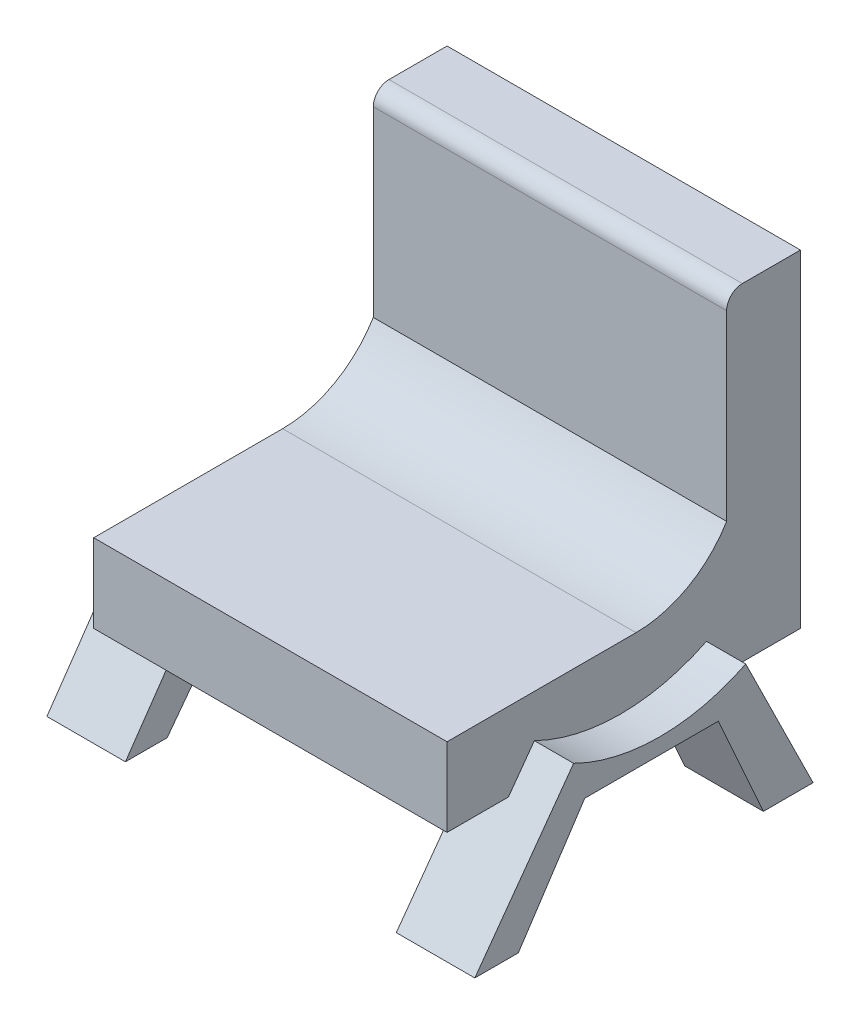
ISO-10303-21;
HEADER;
FILE_DESCRIPTION(('STEP AP214'),'2;1');
FILE_NAME('part.step','',(''),(''),'','','');
FILE_SCHEMA(('AUTOMOTIVE_DESIGN { 1 0 10303 214 1 1 1 1 }'));
ENDSEC;
DATA;
#1=APPLICATION_CONTEXT('core data for automotive mechanical design processes');
#2=APPLICATION_PROTOCOL_DEFINITION('international standard','automotive_design',2000,#1);
#3=PRODUCT_CONTEXT('',#1,'mechanical');
#4=PRODUCT('Part','Part','',(#3));
#5=PRODUCT_RELATED_PRODUCT_CATEGORY('part','',(#4));
#6=PRODUCT_DEFINITION_FORMATION('','',#4);
#7=PRODUCT_DEFINITION_CONTEXT('part definition',#1,'design');
#8=PRODUCT_DEFINITION('design','',#6,#7);
#9=PRODUCT_DEFINITION_SHAPE('','',#8);
#10=(LENGTH_UNIT() NAMED_UNIT(*) SI_UNIT(.MILLI.,.METRE.));
#11=(NAMED_UNIT(*) PLANE_ANGLE_UNIT() SI_UNIT($,.RADIAN.));
#12=(NAMED_UNIT(*) SI_UNIT($,.STERADIAN.) SOLID_ANGLE_UNIT());
#13=UNCERTAINTY_MEASURE_WITH_UNIT(LENGTH_MEASURE(1.E-05),#10,'distance_accuracy_value','');
#14=(GEOMETRIC_REPRESENTATION_CONTEXT(3) GLOBAL_UNCERTAINTY_ASSIGNED_CONTEXT((#13)) GLOBAL_UNIT_ASSIGNED_CONTEXT((#10,
#11,#12)) REPRESENTATION_CONTEXT('',''));
#15=CARTESIAN_POINT('',(0.,0.,0.));
#16=DIRECTION('',(0.,0.,1.));
#17=DIRECTION('',(1.,0.,0.));
#18=AXIS2_PLACEMENT_3D('',#15,#16,#17);
#19=CARTESIAN_POINT('',(-90.,0.,48.1188118811881));
#20=DIRECTION('',(0.,-1.,0.));
#21=DIRECTION('',(0.,0.,-1.));
#22=AXIS2_PLACEMENT_3D('',#19,#20,#21);
#23=PLANE('',#22);
#24=DIRECTION('',(0.,0.,1.));
#25=VECTOR('',#24,1.);
#26=CARTESIAN_POINT('',(-80.,0.,48.1188118811881));
#27=LINE('',#26,#25);
#28=CARTESIAN_POINT('',(-80.,0.,-24.8897802814951));
#29=VERTEX_POINT('',#28);
#30=CARTESIAN_POINT('',(-80.,0.,-13.2379411507735));
#31=VERTEX_POINT('',#30);
#32=EDGE_CURVE('E533',#29,#31,#27,.T.);
#33=ORIENTED_EDGE('',*,*,#32,.F.);
#34=DIRECTION('',(-1.,0.,0.));
#35=VECTOR('',#34,1.);
#36=CARTESIAN_POINT('',(-90.,0.,-24.889780281495));
#37=LINE('',#36,#35);
#38=CARTESIAN_POINT('',(-90.,0.,-24.889780281495));
#39=VERTEX_POINT('',#38);
#40=EDGE_CURVE('E321',#29,#39,#37,.T.);
#41=ORIENTED_EDGE('',*,*,#40,.T.);
#42=DIRECTION('',(0.,0.,-1.));
#43=VECTOR('',#42,1.);
#44=CARTESIAN_POINT('',(-90.,0.,48.1188118811881));
#45=LINE('',#44,#43);
#46=CARTESIAN_POINT('',(-90.,0.,-41.8811881188119));
#47=VERTEX_POINT('',#46);
#48=EDGE_CURVE('E418',#39,#47,#45,.T.);
#49=ORIENTED_EDGE('',*,*,#48,.T.);
#50=DIRECTION('',(1.,0.,0.));
#51=VECTOR('',#50,1.);
#52=CARTESIAN_POINT('',(-90.,0.,-41.8811881188119));
#53=LINE('',#52,#51);
#54=CARTESIAN_POINT('',(0.,0.,-41.8811881188119));
#55=VERTEX_POINT('',#54);
#56=EDGE_CURVE('E498',#47,#55,#53,.T.);
#57=ORIENTED_EDGE('',*,*,#56,.T.);
#58=DIRECTION('',(0.,0.,-1.));
#59=VECTOR('',#58,1.);
#60=CARTESIAN_POINT('',(0.,0.,48.1188118811881));
#61=LINE('',#60,#59);
#62=CARTESIAN_POINT('',(0.,0.,-22.4484647133287));
#63=VERTEX_POINT('',#62);
#64=EDGE_CURVE('E452',#63,#55,#61,.T.);
#65=ORIENTED_EDGE('',*,*,#64,.F.);
#66=DIRECTION('',(1.,0.,0.));
#67=VECTOR('',#66,1.);
#68=CARTESIAN_POINT('',(-90.,0.,-22.4484647133287));
#69=LINE('',#68,#67);
#70=CARTESIAN_POINT('',(-10.,0.,-22.4484647133287));
#71=VERTEX_POINT('',#70);
#72=EDGE_CURVE('E409',#71,#63,#69,.T.);
#73=ORIENTED_EDGE('',*,*,#72,.F.);
#74=DIRECTION('',(0.,0.,1.));
#75=VECTOR('',#74,1.);
#76=CARTESIAN_POINT('',(-9.99999999999999,0.,48.1188118811881));
#77=LINE('',#76,#75);
#78=CARTESIAN_POINT('',(-10.,0.,-10.9568892220624));
#79=VERTEX_POINT('',#78);
#80=EDGE_CURVE('E518',#71,#79,#77,.T.);
#81=ORIENTED_EDGE('',*,*,#80,.T.);
#82=DIRECTION('',(1.,0.,0.));
#83=VECTOR('',#82,1.);
#84=CARTESIAN_POINT('',(-10.,0.,-10.9568892220624));
#85=LINE('',#84,#83);
#86=CARTESIAN_POINT('',(10.,0.,-10.9568892220624));
#87=VERTEX_POINT('',#86);
#88=EDGE_CURVE('E395',#79,#87,#85,.T.);
#89=ORIENTED_EDGE('',*,*,#88,.T.);
#90=DIRECTION('',(0.,0.,-1.));
#91=VECTOR('',#90,1.);
#92=CARTESIAN_POINT('',(10.,0.,-10.9568892220624));
#93=LINE('',#92,#91);
#94=CARTESIAN_POINT('',(10.,0.,23.065200178697));
#95=VERTEX_POINT('',#94);
#96=EDGE_CURVE('E362',#95,#87,#93,.T.);
#97=ORIENTED_EDGE('',*,*,#96,.F.);
#98=DIRECTION('',(1.,0.,0.));
#99=VECTOR('',#98,1.);
#100=CARTESIAN_POINT('',(-10.,0.,23.065200178697));
#101=LINE('',#100,#99);
#102=CARTESIAN_POINT('',(-10.,0.,23.065200178697));
#103=VERTEX_POINT('',#102);
#104=EDGE_CURVE('E398',#103,#95,#101,.T.);
#105=ORIENTED_EDGE('',*,*,#104,.F.);
#106=CARTESIAN_POINT('',(-10.,0.,32.4871370165135));
#107=VERTEX_POINT('',#106);
#108=EDGE_CURVE('E515',#103,#107,#77,.T.);
#109=ORIENTED_EDGE('',*,*,#108,.T.);
#110=DIRECTION('',(-1.,0.,0.));
#111=VECTOR('',#110,1.);
#112=CARTESIAN_POINT('',(-90.,0.,32.4871370165135));
#113=LINE('',#112,#111);
#114=CARTESIAN_POINT('',(0.,0.,32.4871370165135));
#115=VERTEX_POINT('',#114);
#116=EDGE_CURVE('E384',#115,#107,#113,.T.);
#117=ORIENTED_EDGE('',*,*,#116,.F.);
#118=CARTESIAN_POINT('',(0.,0.,48.1188118811881));
#119=VERTEX_POINT('',#118);
#120=EDGE_CURVE('E453',#119,#115,#61,.T.);
#121=ORIENTED_EDGE('',*,*,#120,.F.);
#122=DIRECTION('',(1.,0.,0.));
#123=VECTOR('',#122,1.);
#124=CARTESIAN_POINT('',(-90.,0.,48.1188118811881));
#125=LINE('',#124,#123);
#126=CARTESIAN_POINT('',(-90.,0.,48.1188118811881));
#127=VERTEX_POINT('',#126);
#128=EDGE_CURVE('E448',#127,#119,#125,.T.);
#129=ORIENTED_EDGE('',*,*,#128,.F.);
#130=CARTESIAN_POINT('',(-90.,0.,33.8720481503545));
#131=VERTEX_POINT('',#130);
#132=EDGE_CURVE('E420',#127,#131,#45,.T.);
#133=ORIENTED_EDGE('',*,*,#132,.T.);
#134=DIRECTION('',(1.,0.,0.));
#135=VECTOR('',#134,1.);
#136=CARTESIAN_POINT('',(-90.,0.,33.8720481503545));
#137=LINE('',#136,#135);
#138=CARTESIAN_POINT('',(-80.,0.,33.8720481503545));
#139=VERTEX_POINT('',#138);
#140=EDGE_CURVE('E259',#131,#139,#137,.T.);
#141=ORIENTED_EDGE('',*,*,#140,.T.);
#142=CARTESIAN_POINT('',(-80.,0.,21.7939946870391));
#143=VERTEX_POINT('',#142);
#144=EDGE_CURVE('E529',#143,#139,#27,.T.);
#145=ORIENTED_EDGE('',*,*,#144,.F.);
#146=DIRECTION('',(1.,0.,0.));
#147=VECTOR('',#146,1.);
#148=CARTESIAN_POINT('',(-100.,0.,21.7939946870391));
#149=LINE('',#148,#147);
#150=CARTESIAN_POINT('',(-100.,0.,21.7939946870391));
#151=VERTEX_POINT('',#150);
#152=EDGE_CURVE('E311',#151,#143,#149,.T.);
#153=ORIENTED_EDGE('',*,*,#152,.F.);
#154=DIRECTION('',(0.,0.,1.));
#155=VECTOR('',#154,1.);
#156=CARTESIAN_POINT('',(-100.,0.,21.7939946870391));
#157=LINE('',#156,#155);
#158=CARTESIAN_POINT('',(-100.,0.,-13.2379411507735));
#159=VERTEX_POINT('',#158);
#160=EDGE_CURVE('E269',#159,#151,#157,.T.);
#161=ORIENTED_EDGE('',*,*,#160,.F.);
#162=DIRECTION('',(1.,0.,0.));
#163=VECTOR('',#162,1.);
#164=CARTESIAN_POINT('',(-100.,0.,-13.2379411507735));
#165=LINE('',#164,#163);
#166=EDGE_CURVE('E314',#159,#31,#165,.T.);
#167=ORIENTED_EDGE('',*,*,#166,.T.);
#168=EDGE_LOOP('',(#33,#41,#49,#57,#65,#73,#81,#89,#97,#105,#109,#117,#121,#129,#133,#141,#145,
#153,#161,#167));
#169=FACE_BOUND('',#168,.T.);
#170=ADVANCED_FACE('F39',(#169),#23,.T.);
#171=CARTESIAN_POINT('',(-90.,47.,0.));
#172=DIRECTION('',(1.,0.,0.));
#173=DIRECTION('',(0.,0.,-1.));
#174=AXIS2_PLACEMENT_3D('',#171,#172,#173);
#175=PLANE('',#174);
#176=DIRECTION('',(0.,-0.895025327158244,-0.446015317837043));
#177=VECTOR('',#176,1.);
#178=CARTESIAN_POINT('',(-90.,47.5861817869251,-1.17629938846309));
#179=LINE('',#178,#177);
#180=CARTESIAN_POINT('',(-90.,1.85950714475144,-23.9631375988574));
#181=VERTEX_POINT('',#180);
#182=EDGE_CURVE('E526',#181,#39,#179,.T.);
#183=ORIENTED_EDGE('',*,*,#182,.F.);
#184=CARTESIAN_POINT('',(-90.,-2.60064603361897,-15.0128843272749));
#185=DIRECTION('',(1.,0.,0.));
#186=DIRECTION('',(0.,0.,-1.));
#187=AXIS2_PLACEMENT_3D('',#184,#185,#186);
#188=CIRCLE('',#187,10.);
#189=CARTESIAN_POINT('',(-90.,7.39935396638103,-15.0128843272749));
#190=VERTEX_POINT('',#189);
#191=EDGE_CURVE('E48',#181,#190,#188,.T.);
#192=ORIENTED_EDGE('',*,*,#191,.T.);
#193=DIRECTION('',(0.,0.,-1.));
#194=VECTOR('',#193,1.);
#195=CARTESIAN_POINT('',(-90.,7.39935396638103,0.));
#196=LINE('',#195,#194);
#197=CARTESIAN_POINT('',(-90.,7.39935396638103,23.5205550541489));
#198=VERTEX_POINT('',#197);
#199=EDGE_CURVE('E519',#198,#190,#196,.T.);
#200=ORIENTED_EDGE('',*,*,#199,.F.);
#201=CARTESIAN_POINT('',(-90.,-2.60064603361897,23.5205550541489));
#202=DIRECTION('',(1.,0.,0.));
#203=DIRECTION('',(0.,0.,-1.));
#204=AXIS2_PLACEMENT_3D('',#201,#202,#203);
#205=CIRCLE('',#204,10.);
#206=CARTESIAN_POINT('',(-90.,3.07217092692837,31.7557932250901));
#207=VERTEX_POINT('',#206);
#208=EDGE_CURVE('E11',#198,#207,#205,.T.);
#209=ORIENTED_EDGE('',*,*,#208,.T.);
#210=DIRECTION('',(0.,0.823523817094116,-0.567281696054735));
#211=VECTOR('',#210,1.);
#212=CARTESIAN_POINT('',(-90.,47.699003751963,1.01474495296274));
#213=LINE('',#212,#211);
#214=EDGE_CURVE('E523',#131,#207,#213,.T.);
#215=ORIENTED_EDGE('',*,*,#214,.F.);
#216=ORIENTED_EDGE('',*,*,#132,.F.);
#217=DIRECTION('',(0.,-1.,0.));
#218=VECTOR('',#217,1.);
#219=CARTESIAN_POINT('',(-90.,0.,48.1188118811881));
#220=LINE('',#219,#218);
#221=CARTESIAN_POINT('',(-90.,20.,48.1188118811881));
#222=VERTEX_POINT('',#221);
#223=EDGE_CURVE('E414',#222,#127,#220,.T.);
#224=ORIENTED_EDGE('',*,*,#223,.F.);
#225=DIRECTION('',(0.,0.,1.));
#226=VECTOR('',#225,1.);
#227=CARTESIAN_POINT('',(-90.,20.,48.1188118811881));
#228=LINE('',#227,#226);
#229=CARTESIAN_POINT('',(-90.,20.,0.));
#230=VERTEX_POINT('',#229);
#231=EDGE_CURVE('E444',#230,#222,#228,.T.);
#232=ORIENTED_EDGE('',*,*,#231,.F.);
#233=CARTESIAN_POINT('',(-90.,47.,0.));
#234=DIRECTION('',(-1.,0.,0.));
#235=DIRECTION('',(0.,0.,-1.));
#236=AXIS2_PLACEMENT_3D('',#233,#234,#235);
#237=CIRCLE('',#236,27.);
#238=CARTESIAN_POINT('',(-90.,32.9989677856692,-23.0861667873484));
#239=VERTEX_POINT('',#238);
#240=EDGE_CURVE('E440',#239,#230,#237,.T.);
#241=ORIENTED_EDGE('',*,*,#240,.F.);
#242=DIRECTION('',(0.,-1.,0.));
#243=VECTOR('',#242,1.);
#244=CARTESIAN_POINT('',(-90.,32.9989677856692,-23.0861667873484));
#245=LINE('',#244,#243);
#246=CARTESIAN_POINT('',(-90.,79.4669619131727,-23.0861667873484));
#247=VERTEX_POINT('',#246);
#248=EDGE_CURVE('E436',#247,#239,#245,.T.);
#249=ORIENTED_EDGE('',*,*,#248,.F.);
#250=CARTESIAN_POINT('',(-90.,79.4669619131727,-27.0861667873484));
#251=DIRECTION('',(1.,0.,0.));
#252=DIRECTION('',(0.,0.,1.));
#253=AXIS2_PLACEMENT_3D('',#250,#251,#252);
#254=CIRCLE('',#253,4.);
#255=CARTESIAN_POINT('',(-90.,83.4669619131727,-27.0861667873485));
#256=VERTEX_POINT('',#255);
#257=EDGE_CURVE('E432',#256,#247,#254,.T.);
#258=ORIENTED_EDGE('',*,*,#257,.F.);
#259=DIRECTION('',(0.,0.,1.));
#260=VECTOR('',#259,1.);
#261=CARTESIAN_POINT('',(-90.,83.4669619131727,-27.0861667873485));
#262=LINE('',#261,#260);
#263=CARTESIAN_POINT('',(-90.,83.4669619131727,-41.8811881188119));
#264=VERTEX_POINT('',#263);
#265=EDGE_CURVE('E428',#264,#256,#262,.T.);
#266=ORIENTED_EDGE('',*,*,#265,.F.);
#267=DIRECTION('',(0.,1.,0.));
#268=VECTOR('',#267,1.);
#269=CARTESIAN_POINT('',(-90.,83.4669619131727,-41.8811881188119));
#270=LINE('',#269,#268);
#271=EDGE_CURVE('E424',#47,#264,#270,.T.);
#272=ORIENTED_EDGE('',*,*,#271,.F.);
#273=ORIENTED_EDGE('',*,*,#48,.F.);
#274=EDGE_LOOP('',(#183,#192,#200,#209,#215,#216,#224,#232,#241,#249,#258,#266,#272,#273));
#275=FACE_BOUND('',#274,.T.);
#276=ADVANCED_FACE('F552',(#275),#175,.F.);
#277=CARTESIAN_POINT('',(-90.,0.,48.1188118811881));
#278=DIRECTION('',(0.,0.,1.));
#279=DIRECTION('',(1.,0.,0.));
#280=AXIS2_PLACEMENT_3D('',#277,#278,#279);
#281=PLANE('',#280);
#282=DIRECTION('',(0.,-1.,0.));
#283=VECTOR('',#282,1.);
#284=CARTESIAN_POINT('',(0.,0.,48.1188118811881));
#285=LINE('',#284,#283);
#286=CARTESIAN_POINT('',(0.,20.,48.1188118811881));
#287=VERTEX_POINT('',#286);
#288=EDGE_CURVE('E413',#287,#119,#285,.T.);
#289=ORIENTED_EDGE('',*,*,#288,.F.);
#290=DIRECTION('',(1.,0.,0.));
#291=VECTOR('',#290,1.);
#292=CARTESIAN_POINT('',(-90.,20.,48.1188118811881));
#293=LINE('',#292,#291);
#294=EDGE_CURVE('E479',#222,#287,#293,.T.);
#295=ORIENTED_EDGE('',*,*,#294,.F.);
#296=ORIENTED_EDGE('',*,*,#223,.T.);
#297=ORIENTED_EDGE('',*,*,#128,.T.);
#298=EDGE_LOOP('',(#289,#295,#296,#297));
#299=FACE_BOUND('',#298,.T.);
#300=ADVANCED_FACE('F596',(#299),#281,.T.);
#301=CARTESIAN_POINT('',(-90.,20.,48.1188118811881));
#302=DIRECTION('',(0.,1.,0.));
#303=DIRECTION('',(0.,0.,1.));
#304=AXIS2_PLACEMENT_3D('',#301,#302,#303);
#305=PLANE('',#304);
#306=DIRECTION('',(0.,0.,1.));
#307=VECTOR('',#306,1.);
#308=CARTESIAN_POINT('',(0.,20.,48.1188118811881));
#309=LINE('',#308,#307);
#310=CARTESIAN_POINT('',(0.,20.,0.));
#311=VERTEX_POINT('',#310);
#312=EDGE_CURVE('E419',#311,#287,#309,.T.);
#313=ORIENTED_EDGE('',*,*,#312,.F.);
#314=DIRECTION('',(1.,0.,0.));
#315=VECTOR('',#314,1.);
#316=CARTESIAN_POINT('',(-90.,20.,0.));
#317=LINE('',#316,#315);
#318=EDGE_CURVE('E483',#230,#311,#317,.T.);
#319=ORIENTED_EDGE('',*,*,#318,.F.);
#320=ORIENTED_EDGE('',*,*,#231,.T.);
#321=ORIENTED_EDGE('',*,*,#294,.T.);
#322=EDGE_LOOP('',(#313,#319,#320,#321));
#323=FACE_BOUND('',#322,.T.);
#324=ADVANCED_FACE('F591',(#323),#305,.T.);
#325=CARTESIAN_POINT('',(-90.,47.,0.));
#326=DIRECTION('',(1.,0.,0.));
#327=DIRECTION('',(0.,0.,-1.));
#328=AXIS2_PLACEMENT_3D('',#325,#326,#327);
#329=CYLINDRICAL_SURFACE('',#328,27.);
#330=CARTESIAN_POINT('',(0.,47.,0.));
#331=DIRECTION('',(-1.,0.,0.));
#332=DIRECTION('',(0.,0.,-1.));
#333=AXIS2_PLACEMENT_3D('',#330,#331,#332);
#334=CIRCLE('',#333,27.);
#335=CARTESIAN_POINT('',(0.,32.9989677856692,-23.0861667873484));
#336=VERTEX_POINT('',#335);
#337=EDGE_CURVE('E472',#336,#311,#334,.T.);
#338=ORIENTED_EDGE('',*,*,#337,.F.);
#339=DIRECTION('',(1.,0.,0.));
#340=VECTOR('',#339,1.);
#341=CARTESIAN_POINT('',(-90.,32.9989677856692,-23.0861667873484));
#342=LINE('',#341,#340);
#343=EDGE_CURVE('E486',#239,#336,#342,.T.);
#344=ORIENTED_EDGE('',*,*,#343,.F.);
#345=ORIENTED_EDGE('',*,*,#240,.T.);
#346=ORIENTED_EDGE('',*,*,#318,.T.);
#347=EDGE_LOOP('',(#338,#344,#345,#346));
#348=FACE_BOUND('',#347,.T.);
#349=ADVANCED_FACE('F588',(#348),#329,.F.);
#350=CARTESIAN_POINT('',(-90.,32.9989677856692,-23.0861667873484));
#351=DIRECTION('',(0.,0.,1.));
#352=DIRECTION('',(1.,0.,0.));
#353=AXIS2_PLACEMENT_3D('',#350,#351,#352);
#354=PLANE('',#353);
#355=DIRECTION('',(0.,-1.,0.));
#356=VECTOR('',#355,1.);
#357=CARTESIAN_POINT('',(0.,32.9989677856692,-23.0861667873484));
#358=LINE('',#357,#356);
#359=CARTESIAN_POINT('',(0.,79.4669619131727,-23.0861667873484));
#360=VERTEX_POINT('',#359);
#361=EDGE_CURVE('E468',#360,#336,#358,.T.);
#362=ORIENTED_EDGE('',*,*,#361,.F.);
#363=DIRECTION('',(1.,0.,0.));
#364=VECTOR('',#363,1.);
#365=CARTESIAN_POINT('',(-90.,79.4669619131727,-23.0861667873484));
#366=LINE('',#365,#364);
#367=EDGE_CURVE('E489',#247,#360,#366,.T.);
#368=ORIENTED_EDGE('',*,*,#367,.F.);
#369=ORIENTED_EDGE('',*,*,#248,.T.);
#370=ORIENTED_EDGE('',*,*,#343,.T.);
#371=EDGE_LOOP('',(#362,#368,#369,#370));
#372=FACE_BOUND('',#371,.T.);
#373=ADVANCED_FACE('F584',(#372),#354,.T.);
#374=CARTESIAN_POINT('',(-90.,79.4669619131727,-27.0861667873484));
#375=DIRECTION('',(1.,0.,0.));
#376=DIRECTION('',(0.,0.,-1.));
#377=AXIS2_PLACEMENT_3D('',#374,#375,#376);
#378=CYLINDRICAL_SURFACE('',#377,4.);
#379=CARTESIAN_POINT('',(0.,79.4669619131727,-27.0861667873484));
#380=DIRECTION('',(1.,0.,0.));
#381=DIRECTION('',(0.,0.,1.));
#382=AXIS2_PLACEMENT_3D('',#379,#380,#381);
#383=CIRCLE('',#382,4.);
#384=CARTESIAN_POINT('',(0.,83.4669619131727,-27.0861667873485));
#385=VERTEX_POINT('',#384);
#386=EDGE_CURVE('E464',#385,#360,#383,.T.);
#387=ORIENTED_EDGE('',*,*,#386,.F.);
#388=DIRECTION('',(1.,0.,0.));
#389=VECTOR('',#388,1.);
#390=CARTESIAN_POINT('',(-90.,83.4669619131727,-27.0861667873485));
#391=LINE('',#390,#389);
#392=EDGE_CURVE('E492',#256,#385,#391,.T.);
#393=ORIENTED_EDGE('',*,*,#392,.F.);
#394=ORIENTED_EDGE('',*,*,#257,.T.);
#395=ORIENTED_EDGE('',*,*,#367,.T.);
#396=EDGE_LOOP('',(#387,#393,#394,#395));
#397=FACE_BOUND('',#396,.T.);
#398=ADVANCED_FACE('F580',(#397),#378,.T.);
#399=CARTESIAN_POINT('',(-90.,83.4669619131727,-27.0861667873485));
#400=DIRECTION('',(0.,1.,0.));
#401=DIRECTION('',(0.,0.,1.));
#402=AXIS2_PLACEMENT_3D('',#399,#400,#401);
#403=PLANE('',#402);
#404=DIRECTION('',(0.,0.,1.));
#405=VECTOR('',#404,1.);
#406=CARTESIAN_POINT('',(0.,83.4669619131727,-27.0861667873485));
#407=LINE('',#406,#405);
#408=CARTESIAN_POINT('',(0.,83.4669619131727,-41.8811881188119));
#409=VERTEX_POINT('',#408);
#410=EDGE_CURVE('E460',#409,#385,#407,.T.);
#411=ORIENTED_EDGE('',*,*,#410,.F.);
#412=DIRECTION('',(1.,0.,0.));
#413=VECTOR('',#412,1.);
#414=CARTESIAN_POINT('',(-90.,83.4669619131727,-41.8811881188119));
#415=LINE('',#414,#413);
#416=EDGE_CURVE('E495',#264,#409,#415,.T.);
#417=ORIENTED_EDGE('',*,*,#416,.F.);
#418=ORIENTED_EDGE('',*,*,#265,.T.);
#419=ORIENTED_EDGE('',*,*,#392,.T.);
#420=EDGE_LOOP('',(#411,#417,#418,#419));
#421=FACE_BOUND('',#420,.T.);
#422=ADVANCED_FACE('F576',(#421),#403,.T.);
#423=CARTESIAN_POINT('',(-90.,83.4669619131727,-41.8811881188119));
#424=DIRECTION('',(0.,0.,-1.));
#425=DIRECTION('',(0.,1.,0.));
#426=AXIS2_PLACEMENT_3D('',#423,#424,#425);
#427=PLANE('',#426);
#428=DIRECTION('',(0.,1.,0.));
#429=VECTOR('',#428,1.);
#430=CARTESIAN_POINT('',(0.,83.4669619131727,-41.8811881188119));
#431=LINE('',#430,#429);
#432=EDGE_CURVE('E456',#55,#409,#431,.T.);
#433=ORIENTED_EDGE('',*,*,#432,.F.);
#434=ORIENTED_EDGE('',*,*,#56,.F.);
#435=ORIENTED_EDGE('',*,*,#271,.T.);
#436=ORIENTED_EDGE('',*,*,#416,.T.);
#437=EDGE_LOOP('',(#433,#434,#435,#436));
#438=FACE_BOUND('',#437,.T.);
#439=ADVANCED_FACE('F573',(#438),#427,.T.);
#440=CARTESIAN_POINT('',(0.,47.,0.));
#441=DIRECTION('',(1.,0.,0.));
#442=DIRECTION('',(0.,0.,-1.));
#443=AXIS2_PLACEMENT_3D('',#440,#441,#442);
#444=PLANE('',#443);
#445=DIRECTION('',(0.,0.896761627497086,0.442513935880869));
#446=VECTOR('',#445,1.);
#447=CARTESIAN_POINT('',(0.,46.7047399949122,0.598349161976619));
#448=LINE('',#447,#446);
#449=CARTESIAN_POINT('',(0.,9.12039271113634,-17.9479366447398));
#450=VERTEX_POINT('',#449);
#451=EDGE_CURVE('E511',#63,#450,#448,.T.);
#452=ORIENTED_EDGE('',*,*,#451,.F.);
#453=ORIENTED_EDGE('',*,*,#64,.T.);
#454=ORIENTED_EDGE('',*,*,#432,.T.);
#455=ORIENTED_EDGE('',*,*,#410,.T.);
#456=ORIENTED_EDGE('',*,*,#386,.T.);
#457=ORIENTED_EDGE('',*,*,#361,.T.);
#458=ORIENTED_EDGE('',*,*,#337,.T.);
#459=ORIENTED_EDGE('',*,*,#312,.T.);
#460=ORIENTED_EDGE('',*,*,#288,.T.);
#461=ORIENTED_EDGE('',*,*,#120,.T.);
#462=DIRECTION('',(0.,-0.809979967410933,0.58645754526051));
#463=VECTOR('',#462,1.);
#464=CARTESIAN_POINT('',(0.,46.2671776381693,-1.01213026850901));
#465=LINE('',#464,#463);
#466=CARTESIAN_POINT('',(0.,9.12039271113636,25.8836118228204));
#467=VERTEX_POINT('',#466);
#468=EDGE_CURVE('E482',#467,#115,#465,.T.);
#469=ORIENTED_EDGE('',*,*,#468,.F.);
#470=CARTESIAN_POINT('',(0.,53.53306263219,3.96783758904029));
#471=DIRECTION('',(1.,0.,0.));
#472=DIRECTION('',(0.,0.,-1.));
#473=AXIS2_PLACEMENT_3D('',#470,#471,#472);
#474=CIRCLE('',#473,49.5256136739615);
#475=EDGE_CURVE('E507',#450,#467,#474,.F.);
#476=ORIENTED_EDGE('',*,*,#475,.F.);
#477=EDGE_LOOP('',(#452,#453,#454,#455,#456,#457,#458,#459,#460,#461,#469,#476));
#478=FACE_BOUND('',#477,.T.);
#479=ADVANCED_FACE('F570',(#478),#444,.T.);
#480=CARTESIAN_POINT('',(-10.,53.53306263219,3.96783758904029));
#481=DIRECTION('',(1.,0.,0.));
#482=DIRECTION('',(0.,0.,-1.));
#483=AXIS2_PLACEMENT_3D('',#480,#481,#482);
#484=PLANE('',#483);
#485=ORIENTED_EDGE('',*,*,#80,.F.);
#486=DIRECTION('',(0.,0.896761627497086,0.442513935880869));
#487=VECTOR('',#486,1.);
#488=CARTESIAN_POINT('',(-10.,0.,-22.4484647133287));
#489=LINE('',#488,#487);
#490=CARTESIAN_POINT('',(-10.,-25.6432917765257,-35.1023446575938));
#491=VERTEX_POINT('',#490);
#492=EDGE_CURVE('E346',#491,#71,#489,.T.);
#493=ORIENTED_EDGE('',*,*,#492,.F.);
#494=DIRECTION('',(0.,0.,-1.));
#495=VECTOR('',#494,1.);
#496=CARTESIAN_POINT('',(-10.,-25.6432917765257,-35.1023446575938));
#497=LINE('',#496,#495);
#498=CARTESIAN_POINT('',(-10.,-25.6432917765257,-22.4484647133287));
#499=VERTEX_POINT('',#498);
#500=EDGE_CURVE('E342',#499,#491,#497,.T.);
#501=ORIENTED_EDGE('',*,*,#500,.F.);
#502=DIRECTION('',(0.,-0.912558376415172,-0.40894646304193));
#503=VECTOR('',#502,1.);
#504=CARTESIAN_POINT('',(-10.,-25.6432917765257,-22.4484647133287));
#505=LINE('',#504,#503);
#506=EDGE_CURVE('E338',#79,#499,#505,.T.);
#507=ORIENTED_EDGE('',*,*,#506,.F.);
#508=EDGE_LOOP('',(#485,#493,#501,#507));
#509=FACE_BOUND('',#508,.T.);
#510=ADVANCED_FACE('F616',(#509),#484,.F.);
#511=CARTESIAN_POINT('',(-10.,53.53306263219,3.96783758904029));
#512=DIRECTION('',(1.,0.,0.));
#513=DIRECTION('',(0.,0.,-1.));
#514=AXIS2_PLACEMENT_3D('',#511,#512,#513);
#515=CYLINDRICAL_SURFACE('',#514,49.5256136739615);
#516=DIRECTION('',(1.,0.,0.));
#517=VECTOR('',#516,1.);
#518=CARTESIAN_POINT('',(-10.,9.12039271113634,-17.9479366447398));
#519=LINE('',#518,#517);
#520=CARTESIAN_POINT('',(10.,9.12039271113634,-17.9479366447398));
#521=VERTEX_POINT('',#520);
#522=EDGE_CURVE('E385',#450,#521,#519,.T.);
#523=ORIENTED_EDGE('',*,*,#522,.F.);
#524=ORIENTED_EDGE('',*,*,#475,.T.);
#525=DIRECTION('',(1.,0.,0.));
#526=VECTOR('',#525,1.);
#527=CARTESIAN_POINT('',(-10.,9.12039271113636,25.8836118228204));
#528=LINE('',#527,#526);
#529=CARTESIAN_POINT('',(10.,9.12039271113636,25.8836118228204));
#530=VERTEX_POINT('',#529);
#531=EDGE_CURVE('E381',#467,#530,#528,.T.);
#532=ORIENTED_EDGE('',*,*,#531,.T.);
#533=CARTESIAN_POINT('',(10.,53.53306263219,3.96783758904029));
#534=DIRECTION('',(-1.,0.,0.));
#535=DIRECTION('',(0.,0.,-1.));
#536=AXIS2_PLACEMENT_3D('',#533,#534,#535);
#537=CIRCLE('',#536,49.5256136739615);
#538=EDGE_CURVE('E330',#521,#530,#537,.T.);
#539=ORIENTED_EDGE('',*,*,#538,.F.);
#540=EDGE_LOOP('',(#523,#524,#532,#539));
#541=FACE_BOUND('',#540,.T.);
#542=ADVANCED_FACE('F608',(#541),#515,.F.);
#543=CARTESIAN_POINT('',(-10.,9.12039271113634,-17.9479366447398));
#544=DIRECTION('',(0.,0.442513935880869,-0.896761627497086));
#545=DIRECTION('',(0.,0.896761627497086,0.442513935880869));
#546=AXIS2_PLACEMENT_3D('',#543,#544,#545);
#547=PLANE('',#546);
#548=ORIENTED_EDGE('',*,*,#492,.T.);
#549=ORIENTED_EDGE('',*,*,#72,.T.);
#550=ORIENTED_EDGE('',*,*,#451,.T.);
#551=ORIENTED_EDGE('',*,*,#522,.T.);
#552=DIRECTION('',(0.,0.896761627497086,0.442513935880869));
#553=VECTOR('',#552,1.);
#554=CARTESIAN_POINT('',(10.,9.12039271113634,-17.9479366447398));
#555=LINE('',#554,#553);
#556=CARTESIAN_POINT('',(10.,-25.6432917765257,-35.1023446575938));
#557=VERTEX_POINT('',#556);
#558=EDGE_CURVE('E374',#557,#521,#555,.T.);
#559=ORIENTED_EDGE('',*,*,#558,.F.);
#560=DIRECTION('',(1.,0.,0.));
#561=VECTOR('',#560,1.);
#562=CARTESIAN_POINT('',(-10.,-25.6432917765257,-35.1023446575938));
#563=LINE('',#562,#561);
#564=EDGE_CURVE('E388',#491,#557,#563,.T.);
#565=ORIENTED_EDGE('',*,*,#564,.F.);
#566=EDGE_LOOP('',(#548,#549,#550,#551,#559,#565));
#567=FACE_BOUND('',#566,.T.);
#568=ADVANCED_FACE('F610',(#567),#547,.T.);
#569=CARTESIAN_POINT('',(-10.,-25.6432917765257,-35.1023446575938));
#570=DIRECTION('',(0.,-1.,0.));
#571=DIRECTION('',(0.,0.,-1.));
#572=AXIS2_PLACEMENT_3D('',#569,#570,#571);
#573=PLANE('',#572);
#574=DIRECTION('',(0.,0.,-1.));
#575=VECTOR('',#574,1.);
#576=CARTESIAN_POINT('',(10.,-25.6432917765257,-35.1023446575938));
#577=LINE('',#576,#575);
#578=CARTESIAN_POINT('',(10.,-25.6432917765257,-22.4484647133287));
#579=VERTEX_POINT('',#578);
#580=EDGE_CURVE('E370',#579,#557,#577,.T.);
#581=ORIENTED_EDGE('',*,*,#580,.F.);
#582=DIRECTION('',(1.,0.,0.));
#583=VECTOR('',#582,1.);
#584=CARTESIAN_POINT('',(-10.,-25.6432917765257,-22.4484647133287));
#585=LINE('',#584,#583);
#586=EDGE_CURVE('E392',#499,#579,#585,.T.);
#587=ORIENTED_EDGE('',*,*,#586,.F.);
#588=ORIENTED_EDGE('',*,*,#500,.T.);
#589=ORIENTED_EDGE('',*,*,#564,.T.);
#590=EDGE_LOOP('',(#581,#587,#588,#589));
#591=FACE_BOUND('',#590,.T.);
#592=ADVANCED_FACE('F708',(#591),#573,.T.);
#593=CARTESIAN_POINT('',(-10.,-25.6432917765257,-22.4484647133287));
#594=DIRECTION('',(0.,-0.40894646304193,0.912558376415172));
#595=DIRECTION('',(0.,-0.912558376415172,-0.408946463041931));
#596=AXIS2_PLACEMENT_3D('',#593,#594,#595);
#597=PLANE('',#596);
#598=DIRECTION('',(0.,-0.912558376415172,-0.40894646304193));
#599=VECTOR('',#598,1.);
#600=CARTESIAN_POINT('',(10.,-25.6432917765257,-22.4484647133287));
#601=LINE('',#600,#599);
#602=EDGE_CURVE('E366',#87,#579,#601,.T.);
#603=ORIENTED_EDGE('',*,*,#602,.F.);
#604=ORIENTED_EDGE('',*,*,#88,.F.);
#605=ORIENTED_EDGE('',*,*,#506,.T.);
#606=ORIENTED_EDGE('',*,*,#586,.T.);
#607=EDGE_LOOP('',(#603,#604,#605,#606));
#608=FACE_BOUND('',#607,.T.);
#609=ADVANCED_FACE('F711',(#608),#597,.T.);
#610=CARTESIAN_POINT('',(-10.,0.,23.065200178697));
#611=DIRECTION('',(0.,-0.550376976954958,-0.834916273190265));
#612=DIRECTION('',(0.,0.834916273190266,-0.550376976954958));
#613=AXIS2_PLACEMENT_3D('',#610,#611,#612);
#614=PLANE('',#613);
#615=DIRECTION('',(0.,0.834916273190265,-0.550376976954958));
#616=VECTOR('',#615,1.);
#617=CARTESIAN_POINT('',(10.,0.,23.065200178697));
#618=LINE('',#617,#616);
#619=CARTESIAN_POINT('',(10.,-25.6432917765257,39.9692633288973));
#620=VERTEX_POINT('',#619);
#621=EDGE_CURVE('E358',#620,#95,#618,.T.);
#622=ORIENTED_EDGE('',*,*,#621,.F.);
#623=DIRECTION('',(1.,0.,0.));
#624=VECTOR('',#623,1.);
#625=CARTESIAN_POINT('',(-10.,-25.6432917765257,39.9692633288973));
#626=LINE('',#625,#624);
#627=CARTESIAN_POINT('',(-10.,-25.6432917765257,39.9692633288973));
#628=VERTEX_POINT('',#627);
#629=EDGE_CURVE('E401',#628,#620,#626,.T.);
#630=ORIENTED_EDGE('',*,*,#629,.F.);
#631=DIRECTION('',(0.,0.834916273190265,-0.550376976954958));
#632=VECTOR('',#631,1.);
#633=CARTESIAN_POINT('',(-10.,0.,23.065200178697));
#634=LINE('',#633,#632);
#635=EDGE_CURVE('E334',#628,#103,#634,.T.);
#636=ORIENTED_EDGE('',*,*,#635,.T.);
#637=ORIENTED_EDGE('',*,*,#104,.T.);
#638=EDGE_LOOP('',(#622,#630,#636,#637));
#639=FACE_BOUND('',#638,.T.);
#640=ADVANCED_FACE('F701',(#639),#614,.T.);
#641=CARTESIAN_POINT('',(-10.,-25.6432917765257,39.9692633288973));
#642=DIRECTION('',(0.,-1.,0.));
#643=DIRECTION('',(0.,0.,-1.));
#644=AXIS2_PLACEMENT_3D('',#641,#642,#643);
#645=PLANE('',#644);
#646=DIRECTION('',(0.,0.,-1.));
#647=VECTOR('',#646,1.);
#648=CARTESIAN_POINT('',(10.,-25.6432917765257,39.9692633288973));
#649=LINE('',#648,#647);
#650=CARTESIAN_POINT('',(10.,-25.6432917765257,51.0538949027991));
#651=VERTEX_POINT('',#650);
#652=EDGE_CURVE('E354',#651,#620,#649,.T.);
#653=ORIENTED_EDGE('',*,*,#652,.F.);
#654=DIRECTION('',(1.,0.,0.));
#655=VECTOR('',#654,1.);
#656=CARTESIAN_POINT('',(-10.,-25.6432917765257,51.0538949027991));
#657=LINE('',#656,#655);
#658=CARTESIAN_POINT('',(-10.,-25.6432917765257,51.0538949027991));
#659=VERTEX_POINT('',#658);
#660=EDGE_CURVE('E350',#659,#651,#657,.T.);
#661=ORIENTED_EDGE('',*,*,#660,.F.);
#662=DIRECTION('',(0.,0.,-1.));
#663=VECTOR('',#662,1.);
#664=CARTESIAN_POINT('',(-10.,-25.6432917765257,39.9692633288973));
#665=LINE('',#664,#663);
#666=EDGE_CURVE('E329',#659,#628,#665,.T.);
#667=ORIENTED_EDGE('',*,*,#666,.T.);
#668=ORIENTED_EDGE('',*,*,#629,.T.);
#669=EDGE_LOOP('',(#653,#661,#667,#668));
#670=FACE_BOUND('',#669,.T.);
#671=ADVANCED_FACE('F695',(#670),#645,.T.);
#672=CARTESIAN_POINT('',(-10.,0.,32.4871370165135));
#673=DIRECTION('',(0.,0.58645754526051,0.809979967410933));
#674=DIRECTION('',(0.,-0.809979967410933,0.58645754526051));
#675=AXIS2_PLACEMENT_3D('',#672,#673,#674);
#676=PLANE('',#675);
#677=ORIENTED_EDGE('',*,*,#468,.T.);
#678=ORIENTED_EDGE('',*,*,#116,.T.);
#679=DIRECTION('',(0.,-0.809979967410933,0.58645754526051));
#680=VECTOR('',#679,1.);
#681=CARTESIAN_POINT('',(-10.,0.,32.4871370165135));
#682=LINE('',#681,#680);
#683=EDGE_CURVE('E326',#107,#659,#682,.T.);
#684=ORIENTED_EDGE('',*,*,#683,.T.);
#685=ORIENTED_EDGE('',*,*,#660,.T.);
#686=DIRECTION('',(0.,-0.809979967410933,0.58645754526051));
#687=VECTOR('',#686,1.);
#688=CARTESIAN_POINT('',(10.,0.,32.4871370165135));
#689=LINE('',#688,#687);
#690=EDGE_CURVE('E325',#530,#651,#689,.T.);
#691=ORIENTED_EDGE('',*,*,#690,.F.);
#692=ORIENTED_EDGE('',*,*,#531,.F.);
#693=EDGE_LOOP('',(#677,#678,#684,#685,#691,#692));
#694=FACE_BOUND('',#693,.T.);
#695=ADVANCED_FACE('F603',(#694),#676,.T.);
#696=ORIENTED_EDGE('',*,*,#108,.F.);
#697=ORIENTED_EDGE('',*,*,#635,.F.);
#698=ORIENTED_EDGE('',*,*,#666,.F.);
#699=ORIENTED_EDGE('',*,*,#683,.F.);
#700=EDGE_LOOP('',(#696,#697,#698,#699));
#701=FACE_BOUND('',#700,.T.);
#702=ADVANCED_FACE('F680',(#701),#484,.F.);
#703=CARTESIAN_POINT('',(10.,53.53306263219,3.96783758904029));
#704=DIRECTION('',(1.,0.,0.));
#705=DIRECTION('',(0.,0.,-1.));
#706=AXIS2_PLACEMENT_3D('',#703,#704,#705);
#707=PLANE('',#706);
#708=ORIENTED_EDGE('',*,*,#538,.T.);
#709=ORIENTED_EDGE('',*,*,#690,.T.);
#710=ORIENTED_EDGE('',*,*,#652,.T.);
#711=ORIENTED_EDGE('',*,*,#621,.T.);
#712=ORIENTED_EDGE('',*,*,#96,.T.);
#713=ORIENTED_EDGE('',*,*,#602,.T.);
#714=ORIENTED_EDGE('',*,*,#580,.T.);
#715=ORIENTED_EDGE('',*,*,#558,.T.);
#716=EDGE_LOOP('',(#708,#709,#710,#711,#712,#713,#714,#715));
#717=FACE_BOUND('',#716,.T.);
#718=ADVANCED_FACE('F688',(#717),#707,.T.);
#719=CARTESIAN_POINT('',(-80.,0.,0.));
#720=DIRECTION('',(1.,0.,0.));
#721=DIRECTION('',(0.,0.,-1.));
#722=AXIS2_PLACEMENT_3D('',#719,#720,#721);
#723=PLANE('',#722);
#724=DIRECTION('',(0.,-0.895025327158244,-0.446015317837043));
#725=VECTOR('',#724,1.);
#726=CARTESIAN_POINT('',(-80.,-23.4672017062518,-36.5841213354989));
#727=LINE('',#726,#725);
#728=CARTESIAN_POINT('',(-80.,-23.4672017062518,-36.5841213354989));
#729=VERTEX_POINT('',#728);
#730=EDGE_CURVE('E255',#29,#729,#727,.T.);
#731=ORIENTED_EDGE('',*,*,#730,.F.);
#732=ORIENTED_EDGE('',*,*,#32,.T.);
#733=DIRECTION('',(0.,0.920993183367464,0.389578690627021));
#734=VECTOR('',#733,1.);
#735=CARTESIAN_POINT('',(-80.,0.,-13.2379411507735));
#736=LINE('',#735,#734);
#737=CARTESIAN_POINT('',(-80.,-23.4672017062518,-23.1645311391753));
#738=VERTEX_POINT('',#737);
#739=EDGE_CURVE('E290',#738,#31,#736,.T.);
#740=ORIENTED_EDGE('',*,*,#739,.F.);
#741=DIRECTION('',(0.,0.,1.));
#742=VECTOR('',#741,1.);
#743=CARTESIAN_POINT('',(-80.,-23.4672017062518,-23.1645311391753));
#744=LINE('',#743,#742);
#745=EDGE_CURVE('E287',#729,#738,#744,.T.);
#746=ORIENTED_EDGE('',*,*,#745,.F.);
#747=EDGE_LOOP('',(#731,#732,#740,#746));
#748=FACE_BOUND('',#747,.T.);
#749=ADVANCED_FACE('F622',(#748),#723,.T.);
#750=CARTESIAN_POINT('',(-100.,7.39935396638103,-15.0603057428644));
#751=DIRECTION('',(0.,-1.,0.));
#752=DIRECTION('',(0.,0.,-1.));
#753=AXIS2_PLACEMENT_3D('',#750,#751,#752);
#754=PLANE('',#753);
#755=ORIENTED_EDGE('',*,*,#199,.T.);
#756=DIRECTION('',(1.,0.,0.));
#757=VECTOR('',#756,1.);
#758=CARTESIAN_POINT('',(-100.,7.39935396638103,-15.0128843272749));
#759=LINE('',#758,#757);
#760=CARTESIAN_POINT('',(-100.,7.39935396638103,-15.0128843272749));
#761=VERTEX_POINT('',#760);
#762=EDGE_CURVE('E541',#190,#761,#759,.F.);
#763=ORIENTED_EDGE('',*,*,#762,.T.);
#764=DIRECTION('',(0.,0.,-1.));
#765=VECTOR('',#764,1.);
#766=CARTESIAN_POINT('',(-100.,7.39935396638103,-21.2024821559966));
#767=LINE('',#766,#765);
#768=CARTESIAN_POINT('',(-100.,7.39935396638103,23.5205550541489));
#769=VERTEX_POINT('',#768);
#770=EDGE_CURVE('E248',#769,#761,#767,.T.);
#771=ORIENTED_EDGE('',*,*,#770,.F.);
#772=DIRECTION('',(1.,0.,0.));
#773=VECTOR('',#772,1.);
#774=CARTESIAN_POINT('',(-100.,7.39935396638103,23.5205550541489));
#775=LINE('',#774,#773);
#776=EDGE_CURVE('E537',#769,#198,#775,.T.);
#777=ORIENTED_EDGE('',*,*,#776,.T.);
#778=EDGE_LOOP('',(#755,#763,#771,#777));
#779=FACE_BOUND('',#778,.T.);
#780=ADVANCED_FACE('F557',(#779),#754,.F.);
#781=CARTESIAN_POINT('',(-100.,-23.4672017062518,-36.5841213354989));
#782=DIRECTION('',(0.,-0.446015317837043,0.895025327158244));
#783=DIRECTION('',(0.,-0.895025327158244,-0.446015317837043));
#784=AXIS2_PLACEMENT_3D('',#781,#782,#783);
#785=PLANE('',#784);
#786=DIRECTION('',(0.,-0.895025327158244,-0.446015317837043));
#787=VECTOR('',#786,1.);
#788=CARTESIAN_POINT('',(-100.,-23.4672017062518,-36.5841213354989));
#789=LINE('',#788,#787);
#790=CARTESIAN_POINT('',(-100.,1.85950714475146,-23.9631375988574));
#791=VERTEX_POINT('',#790);
#792=CARTESIAN_POINT('',(-100.,-23.4672017062518,-36.5841213354989));
#793=VERTEX_POINT('',#792);
#794=EDGE_CURVE('E235',#791,#793,#789,.T.);
#795=ORIENTED_EDGE('',*,*,#794,.F.);
#796=DIRECTION('',(1.,0.,0.));
#797=VECTOR('',#796,1.);
#798=CARTESIAN_POINT('',(-100.,1.85950714475146,-23.9631375988574));
#799=LINE('',#798,#797);
#800=EDGE_CURVE('E534',#791,#181,#799,.T.);
#801=ORIENTED_EDGE('',*,*,#800,.T.);
#802=ORIENTED_EDGE('',*,*,#182,.T.);
#803=ORIENTED_EDGE('',*,*,#40,.F.);
#804=ORIENTED_EDGE('',*,*,#730,.T.);
#805=DIRECTION('',(1.,0.,0.));
#806=VECTOR('',#805,1.);
#807=CARTESIAN_POINT('',(-100.,-23.4672017062518,-36.5841213354989));
#808=LINE('',#807,#806);
#809=EDGE_CURVE('E251',#793,#729,#808,.T.);
#810=ORIENTED_EDGE('',*,*,#809,.F.);
#811=EDGE_LOOP('',(#795,#801,#802,#803,#804,#810));
#812=FACE_BOUND('',#811,.T.);
#813=ADVANCED_FACE('F252',(#812),#785,.F.);
#814=CARTESIAN_POINT('',(-100.,-23.4672017062518,-23.1645311391753));
#815=DIRECTION('',(0.,1.,0.));
#816=DIRECTION('',(0.,0.,1.));
#817=AXIS2_PLACEMENT_3D('',#814,#815,#816);
#818=PLANE('',#817);
#819=ORIENTED_EDGE('',*,*,#745,.T.);
#820=DIRECTION('',(1.,0.,0.));
#821=VECTOR('',#820,1.);
#822=CARTESIAN_POINT('',(-100.,-23.4672017062518,-23.1645311391753));
#823=LINE('',#822,#821);
#824=CARTESIAN_POINT('',(-100.,-23.4672017062518,-23.1645311391753));
#825=VERTEX_POINT('',#824);
#826=EDGE_CURVE('E260',#825,#738,#823,.T.);
#827=ORIENTED_EDGE('',*,*,#826,.F.);
#828=DIRECTION('',(0.,0.,1.));
#829=VECTOR('',#828,1.);
#830=CARTESIAN_POINT('',(-100.,-23.4672017062518,-23.1645311391753));
#831=LINE('',#830,#829);
#832=EDGE_CURVE('E240',#793,#825,#831,.T.);
#833=ORIENTED_EDGE('',*,*,#832,.F.);
#834=ORIENTED_EDGE('',*,*,#809,.T.);
#835=EDGE_LOOP('',(#819,#827,#833,#834));
#836=FACE_BOUND('',#835,.T.);
#837=ADVANCED_FACE('F262',(#836),#818,.F.);
#838=CARTESIAN_POINT('',(-100.,0.,-13.2379411507735));
#839=DIRECTION('',(0.,0.389578690627021,-0.920993183367464));
#840=DIRECTION('',(0.,0.920993183367464,0.389578690627021));
#841=AXIS2_PLACEMENT_3D('',#838,#839,#840);
#842=PLANE('',#841);
#843=ORIENTED_EDGE('',*,*,#739,.T.);
#844=ORIENTED_EDGE('',*,*,#166,.F.);
#845=DIRECTION('',(0.,0.920993183367464,0.389578690627021));
#846=VECTOR('',#845,1.);
#847=CARTESIAN_POINT('',(-100.,0.,-13.2379411507735));
#848=LINE('',#847,#846);
#849=EDGE_CURVE('E266',#825,#159,#848,.T.);
#850=ORIENTED_EDGE('',*,*,#849,.F.);
#851=ORIENTED_EDGE('',*,*,#826,.T.);
#852=EDGE_LOOP('',(#843,#844,#850,#851));
#853=FACE_BOUND('',#852,.T.);
#854=ADVANCED_FACE('F625',(#853),#842,.F.);
#855=CARTESIAN_POINT('',(-100.,-23.4672017062518,39.4061904111007));
#856=DIRECTION('',(0.,0.600257234363097,0.799807009593418));
#857=DIRECTION('',(0.,-0.799807009593418,0.600257234363097));
#858=AXIS2_PLACEMENT_3D('',#855,#856,#857);
#859=PLANE('',#858);
#860=DIRECTION('',(0.,-0.799807009593418,0.600257234363097));
#861=VECTOR('',#860,1.);
#862=CARTESIAN_POINT('',(-80.,-23.4672017062518,39.4061904111007));
#863=LINE('',#862,#861);
#864=CARTESIAN_POINT('',(-80.,-23.4672017062518,39.4061904111007));
#865=VERTEX_POINT('',#864);
#866=EDGE_CURVE('E294',#143,#865,#863,.T.);
#867=ORIENTED_EDGE('',*,*,#866,.T.);
#868=DIRECTION('',(1.,0.,0.));
#869=VECTOR('',#868,1.);
#870=CARTESIAN_POINT('',(-100.,-23.4672017062518,39.4061904111007));
#871=LINE('',#870,#869);
#872=CARTESIAN_POINT('',(-100.,-23.4672017062518,39.4061904111007));
#873=VERTEX_POINT('',#872);
#874=EDGE_CURVE('E307',#873,#865,#871,.T.);
#875=ORIENTED_EDGE('',*,*,#874,.F.);
#876=DIRECTION('',(0.,-0.799807009593418,0.600257234363097));
#877=VECTOR('',#876,1.);
#878=CARTESIAN_POINT('',(-100.,-23.4672017062518,39.4061904111007));
#879=LINE('',#878,#877);
#880=EDGE_CURVE('E275',#151,#873,#879,.T.);
#881=ORIENTED_EDGE('',*,*,#880,.F.);
#882=ORIENTED_EDGE('',*,*,#152,.T.);
#883=EDGE_LOOP('',(#867,#875,#881,#882));
#884=FACE_BOUND('',#883,.T.);
#885=ADVANCED_FACE('F633',(#884),#859,.F.);
#886=CARTESIAN_POINT('',(-100.,-23.4672017062518,50.0373535237384));
#887=DIRECTION('',(0.,1.,0.));
#888=DIRECTION('',(0.,0.,1.));
#889=AXIS2_PLACEMENT_3D('',#886,#887,#888);
#890=PLANE('',#889);
#891=DIRECTION('',(0.,0.,1.));
#892=VECTOR('',#891,1.);
#893=CARTESIAN_POINT('',(-80.,-23.4672017062518,50.0373535237384));
#894=LINE('',#893,#892);
#895=CARTESIAN_POINT('',(-80.,-23.4672017062518,50.0373535237384));
#896=VERTEX_POINT('',#895);
#897=EDGE_CURVE('E297',#865,#896,#894,.T.);
#898=ORIENTED_EDGE('',*,*,#897,.T.);
#899=DIRECTION('',(1.,0.,0.));
#900=VECTOR('',#899,1.);
#901=CARTESIAN_POINT('',(-100.,-23.4672017062518,50.0373535237384));
#902=LINE('',#901,#900);
#903=CARTESIAN_POINT('',(-100.,-23.4672017062518,50.0373535237384));
#904=VERTEX_POINT('',#903);
#905=EDGE_CURVE('E284',#904,#896,#902,.T.);
#906=ORIENTED_EDGE('',*,*,#905,.F.);
#907=DIRECTION('',(0.,0.,1.));
#908=VECTOR('',#907,1.);
#909=CARTESIAN_POINT('',(-100.,-23.4672017062518,50.0373535237384));
#910=LINE('',#909,#908);
#911=EDGE_CURVE('E278',#873,#904,#910,.T.);
#912=ORIENTED_EDGE('',*,*,#911,.F.);
#913=ORIENTED_EDGE('',*,*,#874,.T.);
#914=EDGE_LOOP('',(#898,#906,#912,#913));
#915=FACE_BOUND('',#914,.T.);
#916=ADVANCED_FACE('F638',(#915),#890,.F.);
#917=CARTESIAN_POINT('',(-100.,7.39935396638103,28.775027298463));
#918=DIRECTION('',(0.,-0.567281696054735,-0.823523817094116));
#919=DIRECTION('',(0.,0.823523817094116,-0.567281696054735));
#920=AXIS2_PLACEMENT_3D('',#917,#918,#919);
#921=PLANE('',#920);
#922=ORIENTED_EDGE('',*,*,#214,.T.);
#923=DIRECTION('',(1.,0.,0.));
#924=VECTOR('',#923,1.);
#925=CARTESIAN_POINT('',(-100.,3.07217092692838,31.7557932250901));
#926=LINE('',#925,#924);
#927=CARTESIAN_POINT('',(-100.,3.07217092692838,31.7557932250901));
#928=VERTEX_POINT('',#927);
#929=EDGE_CURVE('E60',#207,#928,#926,.F.);
#930=ORIENTED_EDGE('',*,*,#929,.T.);
#931=DIRECTION('',(0.,0.823523817094116,-0.567281696054735));
#932=VECTOR('',#931,1.);
#933=CARTESIAN_POINT('',(-100.,7.39935396638103,28.775027298463));
#934=LINE('',#933,#932);
#935=EDGE_CURVE('E281',#904,#928,#934,.T.);
#936=ORIENTED_EDGE('',*,*,#935,.F.);
#937=ORIENTED_EDGE('',*,*,#905,.T.);
#938=DIRECTION('',(0.,0.823523817094116,-0.567281696054735));
#939=VECTOR('',#938,1.);
#940=CARTESIAN_POINT('',(-80.,7.39935396638103,28.775027298463));
#941=LINE('',#940,#939);
#942=EDGE_CURVE('E300',#896,#139,#941,.T.);
#943=ORIENTED_EDGE('',*,*,#942,.T.);
#944=ORIENTED_EDGE('',*,*,#140,.F.);
#945=EDGE_LOOP('',(#922,#930,#936,#937,#943,#944));
#946=FACE_BOUND('',#945,.T.);
#947=ADVANCED_FACE('F793',(#946),#921,.F.);
#948=CARTESIAN_POINT('',(-100.,0.,0.));
#949=DIRECTION('',(1.,0.,0.));
#950=DIRECTION('',(0.,0.,-1.));
#951=AXIS2_PLACEMENT_3D('',#948,#949,#950);
#952=PLANE('',#951);
#953=ORIENTED_EDGE('',*,*,#770,.T.);
#954=CARTESIAN_POINT('',(-100.,-2.60064603361897,-15.0128843272749));
#955=DIRECTION('',(1.,0.,0.));
#956=DIRECTION('',(0.,0.,-1.));
#957=AXIS2_PLACEMENT_3D('',#954,#955,#956);
#958=CIRCLE('',#957,10.);
#959=EDGE_CURVE('E243',#761,#791,#958,.F.);
#960=ORIENTED_EDGE('',*,*,#959,.T.);
#961=ORIENTED_EDGE('',*,*,#794,.T.);
#962=ORIENTED_EDGE('',*,*,#832,.T.);
#963=ORIENTED_EDGE('',*,*,#849,.T.);
#964=ORIENTED_EDGE('',*,*,#160,.T.);
#965=ORIENTED_EDGE('',*,*,#880,.T.);
#966=ORIENTED_EDGE('',*,*,#911,.T.);
#967=ORIENTED_EDGE('',*,*,#935,.T.);
#968=CARTESIAN_POINT('',(-100.,-2.60064603361897,23.5205550541489));
#969=DIRECTION('',(1.,0.,0.));
#970=DIRECTION('',(0.,0.,-1.));
#971=AXIS2_PLACEMENT_3D('',#968,#969,#970);
#972=CIRCLE('',#971,10.);
#973=EDGE_CURVE('E544',#928,#769,#972,.F.);
#974=ORIENTED_EDGE('',*,*,#973,.T.);
#975=EDGE_LOOP('',(#953,#960,#961,#962,#963,#964,#965,#966,#967,#974));
#976=FACE_BOUND('',#975,.T.);
#977=ADVANCED_FACE('F238',(#976),#952,.F.);
#978=ORIENTED_EDGE('',*,*,#866,.F.);
#979=ORIENTED_EDGE('',*,*,#144,.T.);
#980=ORIENTED_EDGE('',*,*,#942,.F.);
#981=ORIENTED_EDGE('',*,*,#897,.F.);
#982=EDGE_LOOP('',(#978,#979,#980,#981));
#983=FACE_BOUND('',#982,.T.);
#984=ADVANCED_FACE('F645',(#983),#723,.T.);
#985=CARTESIAN_POINT('',(-100.,-2.60064603361897,-15.0128843272749));
#986=DIRECTION('',(1.,0.,0.));
#987=DIRECTION('',(0.,0.,-1.));
#988=AXIS2_PLACEMENT_3D('',#985,#986,#987);
#989=CYLINDRICAL_SURFACE('',#988,10.);
#990=ORIENTED_EDGE('',*,*,#959,.F.);
#991=ORIENTED_EDGE('',*,*,#762,.F.);
#992=ORIENTED_EDGE('',*,*,#191,.F.);
#993=ORIENTED_EDGE('',*,*,#800,.F.);
#994=EDGE_LOOP('',(#990,#991,#992,#993));
#995=FACE_BOUND('',#994,.T.);
#996=ADVANCED_FACE('F560',(#995),#989,.T.);
#997=CARTESIAN_POINT('',(-100.,-2.60064603361897,23.5205550541489));
#998=DIRECTION('',(1.,0.,0.));
#999=DIRECTION('',(0.,0.,-1.));
#1000=AXIS2_PLACEMENT_3D('',#997,#998,#999);
#1001=CYLINDRICAL_SURFACE('',#1000,10.);
#1002=ORIENTED_EDGE('',*,*,#973,.F.);
#1003=ORIENTED_EDGE('',*,*,#929,.F.);
#1004=ORIENTED_EDGE('',*,*,#208,.F.);
#1005=ORIENTED_EDGE('',*,*,#776,.F.);
#1006=EDGE_LOOP('',(#1002,#1003,#1004,#1005));
#1007=FACE_BOUND('',#1006,.T.);
#1008=ADVANCED_FACE('F41',(#1007),#1001,.T.);
#1009=CLOSED_SHELL('',(#170,#276,#300,#324,#349,#373,#398,#422,#439,#479,#510,#542,#568,#592,
#609,#640,#671,#695,#702,#718,#749,#780,#813,#837,#854,#885,#916,#947,#977,#984,#996,#1008));
#1010=MANIFOLD_SOLID_BREP('B2',#1009);
#1011=ADVANCED_BREP_SHAPE_REPRESENTATION('',(#18,#1010),#14);
#1012=SHAPE_DEFINITION_REPRESENTATION(#9,#1011);
ENDSEC;
END-ISO-10303-21;
